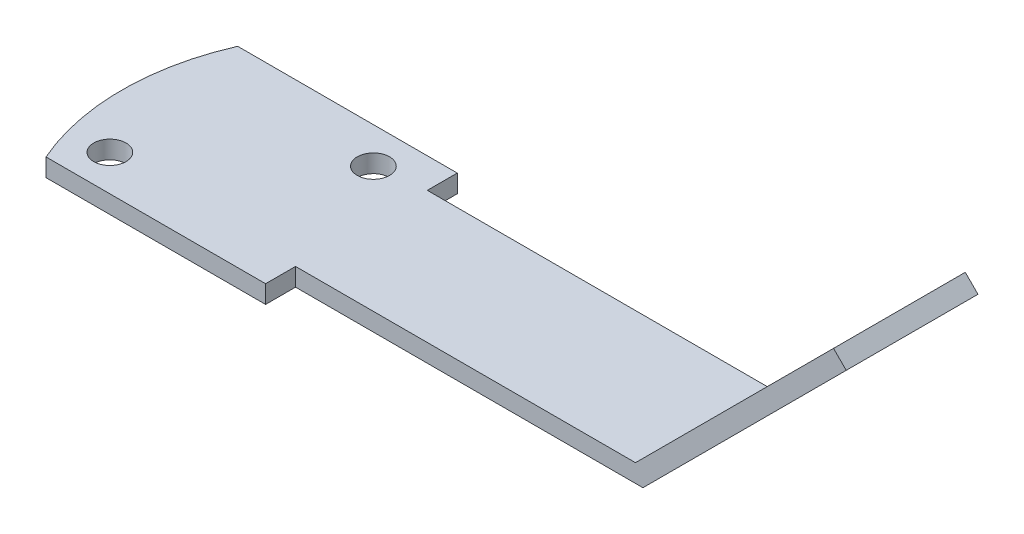
ISO-10303-21;
HEADER;
FILE_DESCRIPTION(('STEP AP214'),'2;1');
FILE_NAME('part.step','',(''),(''),'','','');
FILE_SCHEMA(('AUTOMOTIVE_DESIGN { 1 0 10303 214 1 1 1 1 }'));
ENDSEC;
DATA;
#1=APPLICATION_CONTEXT('core data for automotive mechanical design processes');
#2=APPLICATION_PROTOCOL_DEFINITION('international standard','automotive_design',2000,#1);
#3=PRODUCT_CONTEXT('',#1,'mechanical');
#4=PRODUCT('Part','Part','',(#3));
#5=PRODUCT_RELATED_PRODUCT_CATEGORY('part','',(#4));
#6=PRODUCT_DEFINITION_FORMATION('','',#4);
#7=PRODUCT_DEFINITION_CONTEXT('part definition',#1,'design');
#8=PRODUCT_DEFINITION('design','',#6,#7);
#9=PRODUCT_DEFINITION_SHAPE('','',#8);
#10=(LENGTH_UNIT() NAMED_UNIT(*) SI_UNIT(.MILLI.,.METRE.));
#11=(NAMED_UNIT(*) PLANE_ANGLE_UNIT() SI_UNIT($,.RADIAN.));
#12=(NAMED_UNIT(*) SI_UNIT($,.STERADIAN.) SOLID_ANGLE_UNIT());
#13=UNCERTAINTY_MEASURE_WITH_UNIT(LENGTH_MEASURE(1.E-05),#10,'distance_accuracy_value','');
#14=(GEOMETRIC_REPRESENTATION_CONTEXT(3) GLOBAL_UNCERTAINTY_ASSIGNED_CONTEXT((#13)) GLOBAL_UNIT_ASSIGNED_CONTEXT((#10,
#11,#12)) REPRESENTATION_CONTEXT('',''));
#15=CARTESIAN_POINT('',(0.,0.,0.));
#16=DIRECTION('',(0.,0.,1.));
#17=DIRECTION('',(1.,0.,0.));
#18=AXIS2_PLACEMENT_3D('',#15,#16,#17);
#19=CARTESIAN_POINT('',(0.,1.5,0.));
#20=DIRECTION('',(0.,1.,0.));
#21=DIRECTION('',(0.,0.,1.));
#22=AXIS2_PLACEMENT_3D('',#19,#20,#21);
#23=PLANE('',#22);
#24=CARTESIAN_POINT('',(-45.,1.5,10.5));
#25=DIRECTION('',(0.,1.,0.));
#26=DIRECTION('',(0.,0.,1.));
#27=AXIS2_PLACEMENT_3D('',#24,#25,#26);
#28=CIRCLE('',#27,1.35);
#29=CARTESIAN_POINT('',(-45.,1.5,11.85));
#30=VERTEX_POINT('',#29);
#31=EDGE_CURVE('E203',#30,#30,#28,.T.);
#32=ORIENTED_EDGE('',*,*,#31,.F.);
#33=EDGE_LOOP('',(#32));
#34=FACE_BOUND('',#33,.T.);
#35=CARTESIAN_POINT('',(-33.,1.5,0.499999999999997));
#36=DIRECTION('',(0.,1.,0.));
#37=DIRECTION('',(0.,0.,1.));
#38=AXIS2_PLACEMENT_3D('',#35,#36,#37);
#39=CIRCLE('',#38,1.35);
#40=CARTESIAN_POINT('',(-33.,1.5,1.84999999999999));
#41=VERTEX_POINT('',#40);
#42=EDGE_CURVE('E197',#41,#41,#39,.T.);
#43=ORIENTED_EDGE('',*,*,#42,.F.);
#44=EDGE_LOOP('',(#43));
#45=FACE_BOUND('',#44,.T.);
#46=DIRECTION('',(-1.,0.,0.));
#47=VECTOR('',#46,1.);
#48=CARTESIAN_POINT('',(0.,1.5,11.));
#49=LINE('',#48,#47);
#50=CARTESIAN_POINT('',(-0.621320343559638,1.5,11.));
#51=VERTEX_POINT('',#50);
#52=CARTESIAN_POINT('',(-29.,1.5,11.));
#53=VERTEX_POINT('',#52);
#54=EDGE_CURVE('E108',#51,#53,#49,.T.);
#55=ORIENTED_EDGE('',*,*,#54,.F.);
#56=DIRECTION('',(0.,0.,-1.));
#57=VECTOR('',#56,1.);
#58=CARTESIAN_POINT('',(-0.621320343559638,1.5,0.));
#59=LINE('',#58,#57);
#60=CARTESIAN_POINT('',(-0.621320343559638,1.5,0.));
#61=VERTEX_POINT('',#60);
#62=EDGE_CURVE('E11',#51,#61,#59,.T.);
#63=ORIENTED_EDGE('',*,*,#62,.T.);
#64=DIRECTION('',(-1.,0.,0.));
#65=VECTOR('',#64,1.);
#66=CARTESIAN_POINT('',(0.,1.5,0.));
#67=LINE('',#66,#65);
#68=CARTESIAN_POINT('',(-29.,1.5,0.));
#69=VERTEX_POINT('',#68);
#70=EDGE_CURVE('E119',#61,#69,#67,.T.);
#71=ORIENTED_EDGE('',*,*,#70,.T.);
#72=DIRECTION('',(0.,0.,-1.));
#73=VECTOR('',#72,1.);
#74=CARTESIAN_POINT('',(-29.,1.5,0.));
#75=LINE('',#74,#73);
#76=CARTESIAN_POINT('',(-29.,1.5,-2.50000000000002));
#77=VERTEX_POINT('',#76);
#78=EDGE_CURVE('E56',#69,#77,#75,.T.);
#79=ORIENTED_EDGE('',*,*,#78,.T.);
#80=DIRECTION('',(-1.,0.,0.));
#81=VECTOR('',#80,1.);
#82=CARTESIAN_POINT('',(0.,1.5,-2.50000000000004));
#83=LINE('',#82,#81);
#84=CARTESIAN_POINT('',(-47.3303027798234,1.5,-2.5));
#85=VERTEX_POINT('',#84);
#86=EDGE_CURVE('E95',#77,#85,#83,.T.);
#87=ORIENTED_EDGE('',*,*,#86,.T.);
#88=CARTESIAN_POINT('',(-29.,1.5,5.5));
#89=DIRECTION('',(0.,1.,0.));
#90=DIRECTION('',(0.,0.,1.));
#91=AXIS2_PLACEMENT_3D('',#88,#89,#90);
#92=CIRCLE('',#91,20.);
#93=CARTESIAN_POINT('',(-47.3303027798234,1.5,13.5));
#94=VERTEX_POINT('',#93);
#95=EDGE_CURVE('E150',#94,#85,#92,.F.);
#96=ORIENTED_EDGE('',*,*,#95,.F.);
#97=DIRECTION('',(-1.,0.,0.));
#98=VECTOR('',#97,1.);
#99=CARTESIAN_POINT('',(0.,1.5,13.5));
#100=LINE('',#99,#98);
#101=CARTESIAN_POINT('',(-29.,1.5,13.5));
#102=VERTEX_POINT('',#101);
#103=EDGE_CURVE('E125',#102,#94,#100,.T.);
#104=ORIENTED_EDGE('',*,*,#103,.F.);
#105=EDGE_CURVE('E120',#102,#53,#75,.T.);
#106=ORIENTED_EDGE('',*,*,#105,.T.);
#107=EDGE_LOOP('',(#55,#63,#71,#79,#87,#96,#104,#106));
#108=FACE_BOUND('',#107,.T.);
#109=ADVANCED_FACE('F38',(#34,#45,#108),#23,.T.);
#110=CARTESIAN_POINT('',(0.,1.5,-2.50000000000004));
#111=DIRECTION('',(0.,0.,1.));
#112=DIRECTION('',(1.,0.,0.));
#113=AXIS2_PLACEMENT_3D('',#110,#111,#112);
#114=PLANE('',#113);
#115=DIRECTION('',(-1.,0.,0.));
#116=VECTOR('',#115,1.);
#117=CARTESIAN_POINT('',(0.,0.,-2.50000000000004));
#118=LINE('',#117,#116);
#119=CARTESIAN_POINT('',(-29.,0.,-2.50000000000002));
#120=VERTEX_POINT('',#119);
#121=CARTESIAN_POINT('',(-47.3303027798234,0.,-2.5));
#122=VERTEX_POINT('',#121);
#123=EDGE_CURVE('E153',#120,#122,#118,.T.);
#124=ORIENTED_EDGE('',*,*,#123,.T.);
#125=DIRECTION('',(0.,-1.,0.));
#126=VECTOR('',#125,1.);
#127=CARTESIAN_POINT('',(-47.3303027798234,1.5,-2.5));
#128=LINE('',#127,#126);
#129=EDGE_CURVE('E48',#85,#122,#128,.T.);
#130=ORIENTED_EDGE('',*,*,#129,.F.);
#131=ORIENTED_EDGE('',*,*,#86,.F.);
#132=DIRECTION('',(0.,-1.,0.));
#133=VECTOR('',#132,1.);
#134=CARTESIAN_POINT('',(-29.,1.5,-2.50000000000002));
#135=LINE('',#134,#133);
#136=EDGE_CURVE('E137',#77,#120,#135,.T.);
#137=ORIENTED_EDGE('',*,*,#136,.T.);
#138=EDGE_LOOP('',(#124,#130,#131,#137));
#139=FACE_BOUND('',#138,.T.);
#140=ADVANCED_FACE('F40',(#139),#114,.F.);
#141=CARTESIAN_POINT('',(-29.,1.5,5.5));
#142=DIRECTION('',(0.,-1.,0.));
#143=DIRECTION('',(0.,0.,-1.));
#144=AXIS2_PLACEMENT_3D('',#141,#142,#143);
#145=CYLINDRICAL_SURFACE('',#144,20.);
#146=CARTESIAN_POINT('',(-29.,0.,5.5));
#147=DIRECTION('',(0.,1.,0.));
#148=DIRECTION('',(0.,0.,1.));
#149=AXIS2_PLACEMENT_3D('',#146,#147,#148);
#150=CIRCLE('',#149,20.);
#151=CARTESIAN_POINT('',(-47.3303027798234,0.,13.5));
#152=VERTEX_POINT('',#151);
#153=EDGE_CURVE('E148',#152,#122,#150,.F.);
#154=ORIENTED_EDGE('',*,*,#153,.F.);
#155=DIRECTION('',(0.,-1.,0.));
#156=VECTOR('',#155,1.);
#157=CARTESIAN_POINT('',(-47.3303027798234,1.5,13.5));
#158=LINE('',#157,#156);
#159=EDGE_CURVE('E135',#94,#152,#158,.T.);
#160=ORIENTED_EDGE('',*,*,#159,.F.);
#161=ORIENTED_EDGE('',*,*,#95,.T.);
#162=ORIENTED_EDGE('',*,*,#129,.T.);
#163=EDGE_LOOP('',(#154,#160,#161,#162));
#164=FACE_BOUND('',#163,.T.);
#165=ADVANCED_FACE('F146',(#164),#145,.T.);
#166=CARTESIAN_POINT('',(0.,1.5,13.5));
#167=DIRECTION('',(0.,0.,1.));
#168=DIRECTION('',(1.,0.,0.));
#169=AXIS2_PLACEMENT_3D('',#166,#167,#168);
#170=PLANE('',#169);
#171=DIRECTION('',(-1.,0.,0.));
#172=VECTOR('',#171,1.);
#173=CARTESIAN_POINT('',(0.,0.,13.5));
#174=LINE('',#173,#172);
#175=CARTESIAN_POINT('',(-29.,0.,13.5));
#176=VERTEX_POINT('',#175);
#177=EDGE_CURVE('E159',#176,#152,#174,.T.);
#178=ORIENTED_EDGE('',*,*,#177,.F.);
#179=DIRECTION('',(0.,-1.,0.));
#180=VECTOR('',#179,1.);
#181=CARTESIAN_POINT('',(-29.,1.5,13.5));
#182=LINE('',#181,#180);
#183=EDGE_CURVE('E132',#102,#176,#182,.T.);
#184=ORIENTED_EDGE('',*,*,#183,.F.);
#185=ORIENTED_EDGE('',*,*,#103,.T.);
#186=ORIENTED_EDGE('',*,*,#159,.T.);
#187=EDGE_LOOP('',(#178,#184,#185,#186));
#188=FACE_BOUND('',#187,.T.);
#189=ADVANCED_FACE('F254',(#188),#170,.T.);
#190=CARTESIAN_POINT('',(-29.,1.5,0.));
#191=DIRECTION('',(-1.,0.,0.));
#192=DIRECTION('',(0.,0.,1.));
#193=AXIS2_PLACEMENT_3D('',#190,#191,#192);
#194=PLANE('',#193);
#195=DIRECTION('',(0.,0.,-1.));
#196=VECTOR('',#195,1.);
#197=CARTESIAN_POINT('',(-29.,0.,0.));
#198=LINE('',#197,#196);
#199=CARTESIAN_POINT('',(-29.,0.,11.));
#200=VERTEX_POINT('',#199);
#201=EDGE_CURVE('E130',#176,#200,#198,.T.);
#202=ORIENTED_EDGE('',*,*,#201,.T.);
#203=DIRECTION('',(0.,-1.,0.));
#204=VECTOR('',#203,1.);
#205=CARTESIAN_POINT('',(-29.,1.5,11.));
#206=LINE('',#205,#204);
#207=EDGE_CURVE('E113',#53,#200,#206,.T.);
#208=ORIENTED_EDGE('',*,*,#207,.F.);
#209=ORIENTED_EDGE('',*,*,#105,.F.);
#210=ORIENTED_EDGE('',*,*,#183,.T.);
#211=EDGE_LOOP('',(#202,#208,#209,#210));
#212=FACE_BOUND('',#211,.T.);
#213=ADVANCED_FACE('F128',(#212),#194,.F.);
#214=CARTESIAN_POINT('',(0.,1.5,11.));
#215=DIRECTION('',(0.,0.,1.));
#216=DIRECTION('',(1.,0.,0.));
#217=AXIS2_PLACEMENT_3D('',#214,#215,#216);
#218=PLANE('',#217);
#219=DIRECTION('',(-1.,0.,0.));
#220=VECTOR('',#219,1.);
#221=CARTESIAN_POINT('',(0.,0.,11.));
#222=LINE('',#221,#220);
#223=CARTESIAN_POINT('',(0.,0.,11.));
#224=VERTEX_POINT('',#223);
#225=EDGE_CURVE('E165',#224,#200,#222,.T.);
#226=ORIENTED_EDGE('',*,*,#225,.F.);
#227=DIRECTION('',(0.707106781186551,0.707106781186544,0.));
#228=VECTOR('',#227,1.);
#229=CARTESIAN_POINT('',(0.,0.,11.));
#230=LINE('',#229,#228);
#231=CARTESIAN_POINT('',(16.9705627484772,16.9705627484771,11.));
#232=VERTEX_POINT('',#231);
#233=EDGE_CURVE('E184',#224,#232,#230,.T.);
#234=ORIENTED_EDGE('',*,*,#233,.T.);
#235=DIRECTION('',(0.707106781186544,-0.707106781186551,0.));
#236=VECTOR('',#235,1.);
#237=CARTESIAN_POINT('',(15.9099025766974,18.0312229202569,11.));
#238=LINE('',#237,#236);
#239=CARTESIAN_POINT('',(15.9099025766974,18.0312229202569,11.));
#240=VERTEX_POINT('',#239);
#241=EDGE_CURVE('E155',#240,#232,#238,.T.);
#242=ORIENTED_EDGE('',*,*,#241,.F.);
#243=DIRECTION('',(0.707106781186551,0.707106781186544,0.));
#244=VECTOR('',#243,1.);
#245=CARTESIAN_POINT('',(-1.06066017177982,1.06066017177983,11.));
#246=LINE('',#245,#244);
#247=EDGE_CURVE('E118',#51,#240,#246,.T.);
#248=ORIENTED_EDGE('',*,*,#247,.F.);
#249=ORIENTED_EDGE('',*,*,#54,.T.);
#250=ORIENTED_EDGE('',*,*,#207,.T.);
#251=EDGE_LOOP('',(#226,#234,#242,#248,#249,#250));
#252=FACE_BOUND('',#251,.T.);
#253=ADVANCED_FACE('F111',(#252),#218,.T.);
#254=CARTESIAN_POINT('',(0.,1.5,0.));
#255=DIRECTION('',(0.,0.,1.));
#256=DIRECTION('',(1.,0.,0.));
#257=AXIS2_PLACEMENT_3D('',#254,#255,#256);
#258=PLANE('',#257);
#259=DIRECTION('',(-0.707106781186551,-0.707106781186544,0.));
#260=VECTOR('',#259,1.);
#261=CARTESIAN_POINT('',(0.,0.,0.));
#262=LINE('',#261,#260);
#263=CARTESIAN_POINT('',(16.9705627484772,16.9705627484771,0.));
#264=VERTEX_POINT('',#263);
#265=CARTESIAN_POINT('',(0.,0.,0.));
#266=VERTEX_POINT('',#265);
#267=EDGE_CURVE('E187',#264,#266,#262,.T.);
#268=ORIENTED_EDGE('',*,*,#267,.T.);
#269=DIRECTION('',(-1.,0.,0.));
#270=VECTOR('',#269,1.);
#271=CARTESIAN_POINT('',(0.,0.,0.));
#272=LINE('',#271,#270);
#273=CARTESIAN_POINT('',(-29.,0.,0.));
#274=VERTEX_POINT('',#273);
#275=EDGE_CURVE('E83',#266,#274,#272,.T.);
#276=ORIENTED_EDGE('',*,*,#275,.T.);
#277=DIRECTION('',(0.,-1.,0.));
#278=VECTOR('',#277,1.);
#279=CARTESIAN_POINT('',(-29.,1.5,0.));
#280=LINE('',#279,#278);
#281=EDGE_CURVE('E133',#69,#274,#280,.T.);
#282=ORIENTED_EDGE('',*,*,#281,.F.);
#283=ORIENTED_EDGE('',*,*,#70,.F.);
#284=DIRECTION('',(-0.707106781186551,-0.707106781186544,0.));
#285=VECTOR('',#284,1.);
#286=CARTESIAN_POINT('',(-1.06066017177982,1.06066017177983,0.));
#287=LINE('',#286,#285);
#288=CARTESIAN_POINT('',(15.9099025766974,18.0312229202569,0.));
#289=VERTEX_POINT('',#288);
#290=EDGE_CURVE('E183',#289,#61,#287,.T.);
#291=ORIENTED_EDGE('',*,*,#290,.F.);
#292=DIRECTION('',(0.707106781186544,-0.707106781186551,0.));
#293=VECTOR('',#292,1.);
#294=CARTESIAN_POINT('',(15.9099025766974,18.0312229202569,0.));
#295=LINE('',#294,#293);
#296=EDGE_CURVE('E176',#289,#264,#295,.T.);
#297=ORIENTED_EDGE('',*,*,#296,.T.);
#298=EDGE_LOOP('',(#268,#276,#282,#283,#291,#297));
#299=FACE_BOUND('',#298,.T.);
#300=ADVANCED_FACE('F229',(#299),#258,.F.);
#301=EDGE_CURVE('E89',#274,#120,#198,.T.);
#302=ORIENTED_EDGE('',*,*,#301,.T.);
#303=ORIENTED_EDGE('',*,*,#136,.F.);
#304=ORIENTED_EDGE('',*,*,#78,.F.);
#305=ORIENTED_EDGE('',*,*,#281,.T.);
#306=EDGE_LOOP('',(#302,#303,#304,#305));
#307=FACE_BOUND('',#306,.T.);
#308=ADVANCED_FACE('F243',(#307),#194,.F.);
#309=CARTESIAN_POINT('',(0.,0.,0.));
#310=DIRECTION('',(0.,1.,0.));
#311=DIRECTION('',(0.,0.,1.));
#312=AXIS2_PLACEMENT_3D('',#309,#310,#311);
#313=PLANE('',#312);
#314=CARTESIAN_POINT('',(-45.,0.,10.5));
#315=DIRECTION('',(0.,1.,0.));
#316=DIRECTION('',(0.,0.,1.));
#317=AXIS2_PLACEMENT_3D('',#314,#315,#316);
#318=CIRCLE('',#317,1.35);
#319=CARTESIAN_POINT('',(-45.,0.,11.85));
#320=VERTEX_POINT('',#319);
#321=EDGE_CURVE('E200',#320,#320,#318,.T.);
#322=ORIENTED_EDGE('',*,*,#321,.T.);
#323=EDGE_LOOP('',(#322));
#324=FACE_BOUND('',#323,.T.);
#325=CARTESIAN_POINT('',(-33.,0.,0.499999999999997));
#326=DIRECTION('',(0.,1.,0.));
#327=DIRECTION('',(0.,0.,1.));
#328=AXIS2_PLACEMENT_3D('',#325,#326,#327);
#329=CIRCLE('',#328,1.35);
#330=CARTESIAN_POINT('',(-33.,0.,1.84999999999999));
#331=VERTEX_POINT('',#330);
#332=EDGE_CURVE('E189',#331,#331,#329,.T.);
#333=ORIENTED_EDGE('',*,*,#332,.T.);
#334=EDGE_LOOP('',(#333));
#335=FACE_BOUND('',#334,.T.);
#336=ORIENTED_EDGE('',*,*,#123,.F.);
#337=ORIENTED_EDGE('',*,*,#301,.F.);
#338=ORIENTED_EDGE('',*,*,#275,.F.);
#339=DIRECTION('',(0.,0.,1.));
#340=VECTOR('',#339,1.);
#341=CARTESIAN_POINT('',(0.,0.,0.));
#342=LINE('',#341,#340);
#343=EDGE_CURVE('E167',#266,#224,#342,.T.);
#344=ORIENTED_EDGE('',*,*,#343,.T.);
#345=ORIENTED_EDGE('',*,*,#225,.T.);
#346=ORIENTED_EDGE('',*,*,#201,.F.);
#347=ORIENTED_EDGE('',*,*,#177,.T.);
#348=ORIENTED_EDGE('',*,*,#153,.T.);
#349=EDGE_LOOP('',(#336,#337,#338,#344,#345,#346,#347,#348));
#350=FACE_BOUND('',#349,.T.);
#351=ADVANCED_FACE('F157',(#324,#335,#350),#313,.F.);
#352=CARTESIAN_POINT('',(15.9099025766974,18.0312229202569,0.));
#353=DIRECTION('',(-0.707106781186551,-0.707106781186544,0.));
#354=DIRECTION('',(0.707106781186544,-0.707106781186551,0.));
#355=AXIS2_PLACEMENT_3D('',#352,#353,#354);
#356=PLANE('',#355);
#357=DIRECTION('',(0.,0.,-1.));
#358=VECTOR('',#357,1.);
#359=CARTESIAN_POINT('',(16.9705627484772,16.9705627484771,0.));
#360=LINE('',#359,#358);
#361=EDGE_CURVE('E180',#232,#264,#360,.T.);
#362=ORIENTED_EDGE('',*,*,#361,.T.);
#363=ORIENTED_EDGE('',*,*,#296,.F.);
#364=DIRECTION('',(0.,0.,-1.));
#365=VECTOR('',#364,1.);
#366=CARTESIAN_POINT('',(15.9099025766974,18.0312229202569,0.));
#367=LINE('',#366,#365);
#368=EDGE_CURVE('E179',#240,#289,#367,.T.);
#369=ORIENTED_EDGE('',*,*,#368,.F.);
#370=ORIENTED_EDGE('',*,*,#241,.T.);
#371=EDGE_LOOP('',(#362,#363,#369,#370));
#372=FACE_BOUND('',#371,.T.);
#373=ADVANCED_FACE('F236',(#372),#356,.F.);
#374=CARTESIAN_POINT('',(-1.06066017177982,1.06066017177983,0.));
#375=DIRECTION('',(0.707106781186544,-0.707106781186551,0.));
#376=DIRECTION('',(0.707106781186551,0.707106781186544,0.));
#377=AXIS2_PLACEMENT_3D('',#374,#375,#376);
#378=PLANE('',#377);
#379=CARTESIAN_POINT('',(13.0814754519512,15.2027957955107,5.5));
#380=DIRECTION('',(-0.707106781186544,0.707106781186551,0.));
#381=DIRECTION('',(-0.707106781186551,-0.707106781186544,0.));
#382=AXIS2_PLACEMENT_3D('',#379,#380,#381);
#383=CIRCLE('',#382,1.5);
#384=CARTESIAN_POINT('',(12.0208152801714,14.1421356237309,5.5));
#385=VERTEX_POINT('',#384);
#386=EDGE_CURVE('E206',#385,#385,#383,.T.);
#387=ORIENTED_EDGE('',*,*,#386,.F.);
#388=EDGE_LOOP('',(#387));
#389=FACE_BOUND('',#388,.T.);
#390=ORIENTED_EDGE('',*,*,#62,.F.);
#391=ORIENTED_EDGE('',*,*,#247,.T.);
#392=ORIENTED_EDGE('',*,*,#368,.T.);
#393=ORIENTED_EDGE('',*,*,#290,.T.);
#394=EDGE_LOOP('',(#390,#391,#392,#393));
#395=FACE_BOUND('',#394,.T.);
#396=ADVANCED_FACE('F219',(#389,#395),#378,.F.);
#397=CARTESIAN_POINT('',(0.,0.,0.));
#398=DIRECTION('',(0.707106781186544,-0.707106781186551,0.));
#399=DIRECTION('',(0.707106781186551,0.707106781186544,0.));
#400=AXIS2_PLACEMENT_3D('',#397,#398,#399);
#401=PLANE('',#400);
#402=CARTESIAN_POINT('',(14.142135623731,14.1421356237309,5.5));
#403=DIRECTION('',(0.707106781186544,-0.707106781186551,0.));
#404=DIRECTION('',(0.707106781186551,0.707106781186544,0.));
#405=AXIS2_PLACEMENT_3D('',#402,#403,#404);
#406=CIRCLE('',#405,1.5);
#407=CARTESIAN_POINT('',(15.2027957955108,15.2027957955107,5.5));
#408=VERTEX_POINT('',#407);
#409=EDGE_CURVE('E42',#408,#408,#406,.T.);
#410=ORIENTED_EDGE('',*,*,#409,.F.);
#411=EDGE_LOOP('',(#410));
#412=FACE_BOUND('',#411,.T.);
#413=ORIENTED_EDGE('',*,*,#267,.F.);
#414=ORIENTED_EDGE('',*,*,#361,.F.);
#415=ORIENTED_EDGE('',*,*,#233,.F.);
#416=ORIENTED_EDGE('',*,*,#343,.F.);
#417=EDGE_LOOP('',(#413,#414,#415,#416));
#418=FACE_BOUND('',#417,.T.);
#419=ADVANCED_FACE('F215',(#412,#418),#401,.T.);
#420=CARTESIAN_POINT('',(-33.,1.5,0.499999999999997));
#421=DIRECTION('',(0.,1.,0.));
#422=DIRECTION('',(0.,0.,1.));
#423=AXIS2_PLACEMENT_3D('',#420,#421,#422);
#424=CYLINDRICAL_SURFACE('',#423,1.35);
#425=ORIENTED_EDGE('',*,*,#332,.F.);
#426=EDGE_LOOP('',(#425));
#427=FACE_BOUND('',#426,.T.);
#428=ORIENTED_EDGE('',*,*,#42,.T.);
#429=EDGE_LOOP('',(#428));
#430=FACE_BOUND('',#429,.T.);
#431=ADVANCED_FACE('F218',(#427,#430),#424,.F.);
#432=CARTESIAN_POINT('',(-45.,1.5,10.5));
#433=DIRECTION('',(0.,1.,0.));
#434=DIRECTION('',(0.,0.,1.));
#435=AXIS2_PLACEMENT_3D('',#432,#433,#434);
#436=CYLINDRICAL_SURFACE('',#435,1.35);
#437=ORIENTED_EDGE('',*,*,#321,.F.);
#438=EDGE_LOOP('',(#437));
#439=FACE_BOUND('',#438,.T.);
#440=ORIENTED_EDGE('',*,*,#31,.T.);
#441=EDGE_LOOP('',(#440));
#442=FACE_BOUND('',#441,.T.);
#443=ADVANCED_FACE('F271',(#439,#442),#436,.F.);
#444=CARTESIAN_POINT('',(13.0814754519512,15.2027957955107,5.5));
#445=DIRECTION('',(-0.707106781186544,0.707106781186551,0.));
#446=DIRECTION('',(-0.707106781186551,-0.707106781186544,0.));
#447=AXIS2_PLACEMENT_3D('',#444,#445,#446);
#448=CYLINDRICAL_SURFACE('',#447,1.5);
#449=ORIENTED_EDGE('',*,*,#409,.T.);
#450=EDGE_LOOP('',(#449));
#451=FACE_BOUND('',#450,.T.);
#452=ORIENTED_EDGE('',*,*,#386,.T.);
#453=EDGE_LOOP('',(#452));
#454=FACE_BOUND('',#453,.T.);
#455=ADVANCED_FACE('F213',(#451,#454),#448,.F.);
#456=CLOSED_SHELL('',(#109,#140,#165,#189,#213,#253,#300,#308,#351,#373,#396,#419,#431,#443,#455));
#457=MANIFOLD_SOLID_BREP('B2',#456);
#458=ADVANCED_BREP_SHAPE_REPRESENTATION('',(#18,#457),#14);
#459=SHAPE_DEFINITION_REPRESENTATION(#9,#458);
ENDSEC;
END-ISO-10303-21;
